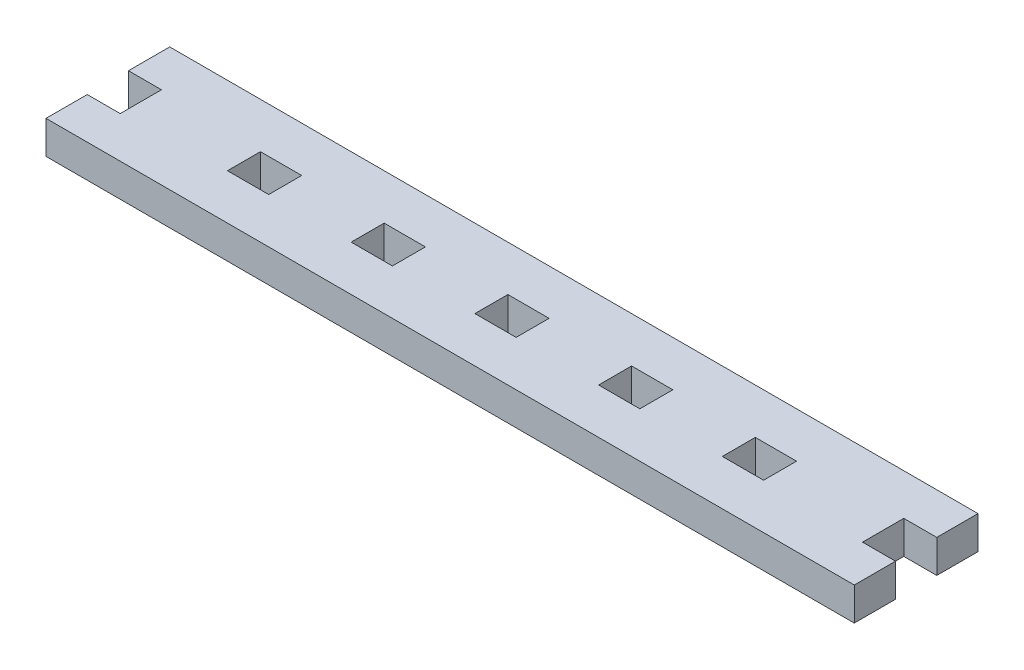
ISO-10303-21;
HEADER;
FILE_DESCRIPTION(('STEP AP214'),'2;1');
FILE_NAME('part.step','',(''),(''),'','','');
FILE_SCHEMA(('AUTOMOTIVE_DESIGN { 1 0 10303 214 1 1 1 1 }'));
ENDSEC;
DATA;
#1=APPLICATION_CONTEXT('core data for automotive mechanical design processes');
#2=APPLICATION_PROTOCOL_DEFINITION('international standard','automotive_design',2000,#1);
#3=PRODUCT_CONTEXT('',#1,'mechanical');
#4=PRODUCT('Part','Part','',(#3));
#5=PRODUCT_RELATED_PRODUCT_CATEGORY('part','',(#4));
#6=PRODUCT_DEFINITION_FORMATION('','',#4);
#7=PRODUCT_DEFINITION_CONTEXT('part definition',#1,'design');
#8=PRODUCT_DEFINITION('design','',#6,#7);
#9=PRODUCT_DEFINITION_SHAPE('','',#8);
#10=(LENGTH_UNIT() NAMED_UNIT(*) SI_UNIT(.MILLI.,.METRE.));
#11=(NAMED_UNIT(*) PLANE_ANGLE_UNIT() SI_UNIT($,.RADIAN.));
#12=(NAMED_UNIT(*) SI_UNIT($,.STERADIAN.) SOLID_ANGLE_UNIT());
#13=UNCERTAINTY_MEASURE_WITH_UNIT(LENGTH_MEASURE(1.E-05),#10,'distance_accuracy_value','');
#14=(GEOMETRIC_REPRESENTATION_CONTEXT(3) GLOBAL_UNCERTAINTY_ASSIGNED_CONTEXT((#13)) GLOBAL_UNIT_ASSIGNED_CONTEXT((#10,
#11,#12)) REPRESENTATION_CONTEXT('',''));
#15=CARTESIAN_POINT('',(0.,0.,0.));
#16=DIRECTION('',(0.,0.,1.));
#17=DIRECTION('',(1.,0.,0.));
#18=AXIS2_PLACEMENT_3D('',#15,#16,#17);
#19=CARTESIAN_POINT('',(97.155,0.,-6.985));
#20=DIRECTION('',(0.,0.,1.));
#21=DIRECTION('',(1.,0.,0.));
#22=AXIS2_PLACEMENT_3D('',#19,#20,#21);
#23=PLANE('',#22);
#24=DIRECTION('',(1.,0.,0.));
#25=VECTOR('',#24,1.);
#26=CARTESIAN_POINT('',(97.155,5.08,-6.985));
#27=LINE('',#26,#25);
#28=CARTESIAN_POINT('',(97.155,5.08,-6.985));
#29=VERTEX_POINT('',#28);
#30=CARTESIAN_POINT('',(103.505,5.08,-6.985));
#31=VERTEX_POINT('',#30);
#32=EDGE_CURVE('E474',#29,#31,#27,.T.);
#33=ORIENTED_EDGE('',*,*,#32,.T.);
#34=DIRECTION('',(0.,1.,0.));
#35=VECTOR('',#34,1.);
#36=CARTESIAN_POINT('',(103.505,0.,-6.985));
#37=LINE('',#36,#35);
#38=CARTESIAN_POINT('',(103.505,0.,-6.985));
#39=VERTEX_POINT('',#38);
#40=EDGE_CURVE('E11',#39,#31,#37,.T.);
#41=ORIENTED_EDGE('',*,*,#40,.F.);
#42=DIRECTION('',(1.,0.,0.));
#43=VECTOR('',#42,1.);
#44=CARTESIAN_POINT('',(97.155,0.,-6.985));
#45=LINE('',#44,#43);
#46=CARTESIAN_POINT('',(97.155,0.,-6.985));
#47=VERTEX_POINT('',#46);
#48=EDGE_CURVE('E478',#47,#39,#45,.T.);
#49=ORIENTED_EDGE('',*,*,#48,.F.);
#50=DIRECTION('',(0.,1.,0.));
#51=VECTOR('',#50,1.);
#52=CARTESIAN_POINT('',(97.155,0.,-6.985));
#53=LINE('',#52,#51);
#54=EDGE_CURVE('E483',#47,#29,#53,.T.);
#55=ORIENTED_EDGE('',*,*,#54,.T.);
#56=EDGE_LOOP('',(#33,#41,#49,#55));
#57=FACE_BOUND('',#56,.T.);
#58=ADVANCED_FACE('F33',(#57),#23,.F.);
#59=CARTESIAN_POINT('',(103.505,0.,-12.065));
#60=DIRECTION('',(1.,0.,0.));
#61=DIRECTION('',(0.,0.,-1.));
#62=AXIS2_PLACEMENT_3D('',#59,#60,#61);
#63=PLANE('',#62);
#64=DIRECTION('',(0.,0.,-1.));
#65=VECTOR('',#64,1.);
#66=CARTESIAN_POINT('',(103.505,5.08,-12.065));
#67=LINE('',#66,#65);
#68=CARTESIAN_POINT('',(103.505,5.08,-12.065));
#69=VERTEX_POINT('',#68);
#70=EDGE_CURVE('E471',#31,#69,#67,.T.);
#71=ORIENTED_EDGE('',*,*,#70,.T.);
#72=DIRECTION('',(0.,1.,0.));
#73=VECTOR('',#72,1.);
#74=CARTESIAN_POINT('',(103.505,0.,-12.065));
#75=LINE('',#74,#73);
#76=CARTESIAN_POINT('',(103.505,0.,-12.065));
#77=VERTEX_POINT('',#76);
#78=EDGE_CURVE('E40',#77,#69,#75,.T.);
#79=ORIENTED_EDGE('',*,*,#78,.F.);
#80=DIRECTION('',(0.,0.,-1.));
#81=VECTOR('',#80,1.);
#82=CARTESIAN_POINT('',(103.505,0.,-12.065));
#83=LINE('',#82,#81);
#84=EDGE_CURVE('E54',#39,#77,#83,.T.);
#85=ORIENTED_EDGE('',*,*,#84,.F.);
#86=ORIENTED_EDGE('',*,*,#40,.T.);
#87=EDGE_LOOP('',(#71,#79,#85,#86));
#88=FACE_BOUND('',#87,.T.);
#89=ADVANCED_FACE('F493',(#88),#63,.F.);
#90=CARTESIAN_POINT('',(97.155,0.,-12.065));
#91=DIRECTION('',(0.,0.,-1.));
#92=DIRECTION('',(-1.,0.,0.));
#93=AXIS2_PLACEMENT_3D('',#90,#91,#92);
#94=PLANE('',#93);
#95=DIRECTION('',(-1.,0.,0.));
#96=VECTOR('',#95,1.);
#97=CARTESIAN_POINT('',(97.155,5.08,-12.065));
#98=LINE('',#97,#96);
#99=CARTESIAN_POINT('',(97.155,5.08,-12.065));
#100=VERTEX_POINT('',#99);
#101=EDGE_CURVE('E468',#69,#100,#98,.T.);
#102=ORIENTED_EDGE('',*,*,#101,.T.);
#103=DIRECTION('',(0.,1.,0.));
#104=VECTOR('',#103,1.);
#105=CARTESIAN_POINT('',(97.155,0.,-12.065));
#106=LINE('',#105,#104);
#107=CARTESIAN_POINT('',(97.155,0.,-12.065));
#108=VERTEX_POINT('',#107);
#109=EDGE_CURVE('E486',#108,#100,#106,.T.);
#110=ORIENTED_EDGE('',*,*,#109,.F.);
#111=DIRECTION('',(-1.,0.,0.));
#112=VECTOR('',#111,1.);
#113=CARTESIAN_POINT('',(97.155,0.,-12.065));
#114=LINE('',#113,#112);
#115=EDGE_CURVE('E481',#77,#108,#114,.T.);
#116=ORIENTED_EDGE('',*,*,#115,.F.);
#117=ORIENTED_EDGE('',*,*,#78,.T.);
#118=EDGE_LOOP('',(#102,#110,#116,#117));
#119=FACE_BOUND('',#118,.T.);
#120=ADVANCED_FACE('F490',(#119),#94,.F.);
#121=CARTESIAN_POINT('',(97.155,0.,-12.065));
#122=DIRECTION('',(-1.,0.,0.));
#123=DIRECTION('',(0.,0.,1.));
#124=AXIS2_PLACEMENT_3D('',#121,#122,#123);
#125=PLANE('',#124);
#126=DIRECTION('',(0.,0.,1.));
#127=VECTOR('',#126,1.);
#128=CARTESIAN_POINT('',(97.155,5.08,-12.065));
#129=LINE('',#128,#127);
#130=EDGE_CURVE('E466',#100,#29,#129,.T.);
#131=ORIENTED_EDGE('',*,*,#130,.T.);
#132=ORIENTED_EDGE('',*,*,#54,.F.);
#133=DIRECTION('',(0.,0.,1.));
#134=VECTOR('',#133,1.);
#135=CARTESIAN_POINT('',(97.155,0.,-12.065));
#136=LINE('',#135,#134);
#137=EDGE_CURVE('E47',#108,#47,#136,.T.);
#138=ORIENTED_EDGE('',*,*,#137,.F.);
#139=ORIENTED_EDGE('',*,*,#109,.T.);
#140=EDGE_LOOP('',(#131,#132,#138,#139));
#141=FACE_BOUND('',#140,.T.);
#142=ADVANCED_FACE('F499',(#141),#125,.F.);
#143=CARTESIAN_POINT('',(78.105,0.,-6.985));
#144=DIRECTION('',(0.,0.,1.));
#145=DIRECTION('',(1.,0.,0.));
#146=AXIS2_PLACEMENT_3D('',#143,#144,#145);
#147=PLANE('',#146);
#148=DIRECTION('',(1.,0.,0.));
#149=VECTOR('',#148,1.);
#150=CARTESIAN_POINT('',(78.105,5.08,-6.985));
#151=LINE('',#150,#149);
#152=CARTESIAN_POINT('',(78.105,5.08,-6.985));
#153=VERTEX_POINT('',#152);
#154=CARTESIAN_POINT('',(84.455,5.08,-6.985));
#155=VERTEX_POINT('',#154);
#156=EDGE_CURVE('E442',#153,#155,#151,.T.);
#157=ORIENTED_EDGE('',*,*,#156,.T.);
#158=DIRECTION('',(0.,1.,0.));
#159=VECTOR('',#158,1.);
#160=CARTESIAN_POINT('',(84.455,0.,-6.985));
#161=LINE('',#160,#159);
#162=CARTESIAN_POINT('',(84.455,0.,-6.985));
#163=VERTEX_POINT('',#162);
#164=EDGE_CURVE('E463',#163,#155,#161,.T.);
#165=ORIENTED_EDGE('',*,*,#164,.F.);
#166=DIRECTION('',(1.,0.,0.));
#167=VECTOR('',#166,1.);
#168=CARTESIAN_POINT('',(78.105,0.,-6.985));
#169=LINE('',#168,#167);
#170=CARTESIAN_POINT('',(78.105,0.,-6.985));
#171=VERTEX_POINT('',#170);
#172=EDGE_CURVE('E447',#171,#163,#169,.T.);
#173=ORIENTED_EDGE('',*,*,#172,.F.);
#174=DIRECTION('',(0.,1.,0.));
#175=VECTOR('',#174,1.);
#176=CARTESIAN_POINT('',(78.105,0.,-6.985));
#177=LINE('',#176,#175);
#178=EDGE_CURVE('E454',#171,#153,#177,.T.);
#179=ORIENTED_EDGE('',*,*,#178,.T.);
#180=EDGE_LOOP('',(#157,#165,#173,#179));
#181=FACE_BOUND('',#180,.T.);
#182=ADVANCED_FACE('F501',(#181),#147,.F.);
#183=CARTESIAN_POINT('',(84.455,0.,-12.065));
#184=DIRECTION('',(1.,0.,0.));
#185=DIRECTION('',(0.,0.,-1.));
#186=AXIS2_PLACEMENT_3D('',#183,#184,#185);
#187=PLANE('',#186);
#188=DIRECTION('',(0.,0.,-1.));
#189=VECTOR('',#188,1.);
#190=CARTESIAN_POINT('',(84.455,5.08,-12.065));
#191=LINE('',#190,#189);
#192=CARTESIAN_POINT('',(84.455,5.08,-12.065));
#193=VERTEX_POINT('',#192);
#194=EDGE_CURVE('E439',#155,#193,#191,.T.);
#195=ORIENTED_EDGE('',*,*,#194,.T.);
#196=DIRECTION('',(0.,1.,0.));
#197=VECTOR('',#196,1.);
#198=CARTESIAN_POINT('',(84.455,0.,-12.065));
#199=LINE('',#198,#197);
#200=CARTESIAN_POINT('',(84.455,0.,-12.065));
#201=VERTEX_POINT('',#200);
#202=EDGE_CURVE('E460',#201,#193,#199,.T.);
#203=ORIENTED_EDGE('',*,*,#202,.F.);
#204=DIRECTION('',(0.,0.,-1.));
#205=VECTOR('',#204,1.);
#206=CARTESIAN_POINT('',(84.455,0.,-12.065));
#207=LINE('',#206,#205);
#208=EDGE_CURVE('E449',#163,#201,#207,.T.);
#209=ORIENTED_EDGE('',*,*,#208,.F.);
#210=ORIENTED_EDGE('',*,*,#164,.T.);
#211=EDGE_LOOP('',(#195,#203,#209,#210));
#212=FACE_BOUND('',#211,.T.);
#213=ADVANCED_FACE('F507',(#212),#187,.F.);
#214=CARTESIAN_POINT('',(78.105,0.,-12.065));
#215=DIRECTION('',(0.,0.,-1.));
#216=DIRECTION('',(-1.,0.,0.));
#217=AXIS2_PLACEMENT_3D('',#214,#215,#216);
#218=PLANE('',#217);
#219=DIRECTION('',(-1.,0.,0.));
#220=VECTOR('',#219,1.);
#221=CARTESIAN_POINT('',(78.105,5.08,-12.065));
#222=LINE('',#221,#220);
#223=CARTESIAN_POINT('',(78.105,5.08,-12.065));
#224=VERTEX_POINT('',#223);
#225=EDGE_CURVE('E436',#193,#224,#222,.T.);
#226=ORIENTED_EDGE('',*,*,#225,.T.);
#227=DIRECTION('',(0.,1.,0.));
#228=VECTOR('',#227,1.);
#229=CARTESIAN_POINT('',(78.105,0.,-12.065));
#230=LINE('',#229,#228);
#231=CARTESIAN_POINT('',(78.105,0.,-12.065));
#232=VERTEX_POINT('',#231);
#233=EDGE_CURVE('E457',#232,#224,#230,.T.);
#234=ORIENTED_EDGE('',*,*,#233,.F.);
#235=DIRECTION('',(-1.,0.,0.));
#236=VECTOR('',#235,1.);
#237=CARTESIAN_POINT('',(78.105,0.,-12.065));
#238=LINE('',#237,#236);
#239=EDGE_CURVE('E451',#201,#232,#238,.T.);
#240=ORIENTED_EDGE('',*,*,#239,.F.);
#241=ORIENTED_EDGE('',*,*,#202,.T.);
#242=EDGE_LOOP('',(#226,#234,#240,#241));
#243=FACE_BOUND('',#242,.T.);
#244=ADVANCED_FACE('F540',(#243),#218,.F.);
#245=CARTESIAN_POINT('',(78.105,0.,-12.065));
#246=DIRECTION('',(-1.,0.,0.));
#247=DIRECTION('',(0.,0.,1.));
#248=AXIS2_PLACEMENT_3D('',#245,#246,#247);
#249=PLANE('',#248);
#250=DIRECTION('',(0.,0.,1.));
#251=VECTOR('',#250,1.);
#252=CARTESIAN_POINT('',(78.105,5.08,-12.065));
#253=LINE('',#252,#251);
#254=EDGE_CURVE('E434',#224,#153,#253,.T.);
#255=ORIENTED_EDGE('',*,*,#254,.T.);
#256=ORIENTED_EDGE('',*,*,#178,.F.);
#257=DIRECTION('',(0.,0.,1.));
#258=VECTOR('',#257,1.);
#259=CARTESIAN_POINT('',(78.105,0.,-12.065));
#260=LINE('',#259,#258);
#261=EDGE_CURVE('E445',#232,#171,#260,.T.);
#262=ORIENTED_EDGE('',*,*,#261,.F.);
#263=ORIENTED_EDGE('',*,*,#233,.T.);
#264=EDGE_LOOP('',(#255,#256,#262,#263));
#265=FACE_BOUND('',#264,.T.);
#266=ADVANCED_FACE('F550',(#265),#249,.F.);
#267=CARTESIAN_POINT('',(59.055,0.,-6.985));
#268=DIRECTION('',(0.,0.,1.));
#269=DIRECTION('',(1.,0.,0.));
#270=AXIS2_PLACEMENT_3D('',#267,#268,#269);
#271=PLANE('',#270);
#272=DIRECTION('',(1.,0.,0.));
#273=VECTOR('',#272,1.);
#274=CARTESIAN_POINT('',(59.055,5.08,-6.985));
#275=LINE('',#274,#273);
#276=CARTESIAN_POINT('',(59.055,5.08,-6.985));
#277=VERTEX_POINT('',#276);
#278=CARTESIAN_POINT('',(65.405,5.08,-6.985));
#279=VERTEX_POINT('',#278);
#280=EDGE_CURVE('E410',#277,#279,#275,.T.);
#281=ORIENTED_EDGE('',*,*,#280,.T.);
#282=DIRECTION('',(0.,1.,0.));
#283=VECTOR('',#282,1.);
#284=CARTESIAN_POINT('',(65.405,0.,-6.985));
#285=LINE('',#284,#283);
#286=CARTESIAN_POINT('',(65.405,0.,-6.985));
#287=VERTEX_POINT('',#286);
#288=EDGE_CURVE('E431',#287,#279,#285,.T.);
#289=ORIENTED_EDGE('',*,*,#288,.F.);
#290=DIRECTION('',(1.,0.,0.));
#291=VECTOR('',#290,1.);
#292=CARTESIAN_POINT('',(59.055,0.,-6.985));
#293=LINE('',#292,#291);
#294=CARTESIAN_POINT('',(59.055,0.,-6.985));
#295=VERTEX_POINT('',#294);
#296=EDGE_CURVE('E415',#295,#287,#293,.T.);
#297=ORIENTED_EDGE('',*,*,#296,.F.);
#298=DIRECTION('',(0.,1.,0.));
#299=VECTOR('',#298,1.);
#300=CARTESIAN_POINT('',(59.055,0.,-6.985));
#301=LINE('',#300,#299);
#302=EDGE_CURVE('E422',#295,#277,#301,.T.);
#303=ORIENTED_EDGE('',*,*,#302,.T.);
#304=EDGE_LOOP('',(#281,#289,#297,#303));
#305=FACE_BOUND('',#304,.T.);
#306=ADVANCED_FACE('F560',(#305),#271,.F.);
#307=CARTESIAN_POINT('',(65.405,0.,-12.065));
#308=DIRECTION('',(1.,0.,0.));
#309=DIRECTION('',(0.,0.,-1.));
#310=AXIS2_PLACEMENT_3D('',#307,#308,#309);
#311=PLANE('',#310);
#312=DIRECTION('',(0.,0.,-1.));
#313=VECTOR('',#312,1.);
#314=CARTESIAN_POINT('',(65.405,5.08,-12.065));
#315=LINE('',#314,#313);
#316=CARTESIAN_POINT('',(65.405,5.08,-12.065));
#317=VERTEX_POINT('',#316);
#318=EDGE_CURVE('E407',#279,#317,#315,.T.);
#319=ORIENTED_EDGE('',*,*,#318,.T.);
#320=DIRECTION('',(0.,1.,0.));
#321=VECTOR('',#320,1.);
#322=CARTESIAN_POINT('',(65.405,0.,-12.065));
#323=LINE('',#322,#321);
#324=CARTESIAN_POINT('',(65.405,0.,-12.065));
#325=VERTEX_POINT('',#324);
#326=EDGE_CURVE('E428',#325,#317,#323,.T.);
#327=ORIENTED_EDGE('',*,*,#326,.F.);
#328=DIRECTION('',(0.,0.,-1.));
#329=VECTOR('',#328,1.);
#330=CARTESIAN_POINT('',(65.405,0.,-12.065));
#331=LINE('',#330,#329);
#332=EDGE_CURVE('E417',#287,#325,#331,.T.);
#333=ORIENTED_EDGE('',*,*,#332,.F.);
#334=ORIENTED_EDGE('',*,*,#288,.T.);
#335=EDGE_LOOP('',(#319,#327,#333,#334));
#336=FACE_BOUND('',#335,.T.);
#337=ADVANCED_FACE('F570',(#336),#311,.F.);
#338=CARTESIAN_POINT('',(59.055,0.,-12.065));
#339=DIRECTION('',(0.,0.,-1.));
#340=DIRECTION('',(-1.,0.,0.));
#341=AXIS2_PLACEMENT_3D('',#338,#339,#340);
#342=PLANE('',#341);
#343=DIRECTION('',(-1.,0.,0.));
#344=VECTOR('',#343,1.);
#345=CARTESIAN_POINT('',(59.055,5.08,-12.065));
#346=LINE('',#345,#344);
#347=CARTESIAN_POINT('',(59.055,5.08,-12.065));
#348=VERTEX_POINT('',#347);
#349=EDGE_CURVE('E404',#317,#348,#346,.T.);
#350=ORIENTED_EDGE('',*,*,#349,.T.);
#351=DIRECTION('',(0.,1.,0.));
#352=VECTOR('',#351,1.);
#353=CARTESIAN_POINT('',(59.055,0.,-12.065));
#354=LINE('',#353,#352);
#355=CARTESIAN_POINT('',(59.055,0.,-12.065));
#356=VERTEX_POINT('',#355);
#357=EDGE_CURVE('E425',#356,#348,#354,.T.);
#358=ORIENTED_EDGE('',*,*,#357,.F.);
#359=DIRECTION('',(-1.,0.,0.));
#360=VECTOR('',#359,1.);
#361=CARTESIAN_POINT('',(59.055,0.,-12.065));
#362=LINE('',#361,#360);
#363=EDGE_CURVE('E419',#325,#356,#362,.T.);
#364=ORIENTED_EDGE('',*,*,#363,.F.);
#365=ORIENTED_EDGE('',*,*,#326,.T.);
#366=EDGE_LOOP('',(#350,#358,#364,#365));
#367=FACE_BOUND('',#366,.T.);
#368=ADVANCED_FACE('F580',(#367),#342,.F.);
#369=CARTESIAN_POINT('',(59.055,0.,-12.065));
#370=DIRECTION('',(-1.,0.,0.));
#371=DIRECTION('',(0.,0.,1.));
#372=AXIS2_PLACEMENT_3D('',#369,#370,#371);
#373=PLANE('',#372);
#374=DIRECTION('',(0.,0.,1.));
#375=VECTOR('',#374,1.);
#376=CARTESIAN_POINT('',(59.055,5.08,-12.065));
#377=LINE('',#376,#375);
#378=EDGE_CURVE('E402',#348,#277,#377,.T.);
#379=ORIENTED_EDGE('',*,*,#378,.T.);
#380=ORIENTED_EDGE('',*,*,#302,.F.);
#381=DIRECTION('',(0.,0.,1.));
#382=VECTOR('',#381,1.);
#383=CARTESIAN_POINT('',(59.055,0.,-12.065));
#384=LINE('',#383,#382);
#385=EDGE_CURVE('E413',#356,#295,#384,.T.);
#386=ORIENTED_EDGE('',*,*,#385,.F.);
#387=ORIENTED_EDGE('',*,*,#357,.T.);
#388=EDGE_LOOP('',(#379,#380,#386,#387));
#389=FACE_BOUND('',#388,.T.);
#390=ADVANCED_FACE('F590',(#389),#373,.F.);
#391=CARTESIAN_POINT('',(0.,5.08,0.));
#392=DIRECTION('',(1.,0.,0.));
#393=DIRECTION('',(0.,0.,-1.));
#394=AXIS2_PLACEMENT_3D('',#391,#392,#393);
#395=PLANE('',#394);
#396=DIRECTION('',(0.,0.,1.));
#397=VECTOR('',#396,1.);
#398=CARTESIAN_POINT('',(0.,0.,0.));
#399=LINE('',#398,#397);
#400=CARTESIAN_POINT('',(0.,0.,-6.35));
#401=VERTEX_POINT('',#400);
#402=CARTESIAN_POINT('',(0.,0.,0.));
#403=VERTEX_POINT('',#402);
#404=EDGE_CURVE('E310',#401,#403,#399,.T.);
#405=ORIENTED_EDGE('',*,*,#404,.T.);
#406=DIRECTION('',(0.,-1.,0.));
#407=VECTOR('',#406,1.);
#408=CARTESIAN_POINT('',(0.,5.08,0.));
#409=LINE('',#408,#407);
#410=CARTESIAN_POINT('',(0.,5.08,0.));
#411=VERTEX_POINT('',#410);
#412=EDGE_CURVE('E399',#411,#403,#409,.T.);
#413=ORIENTED_EDGE('',*,*,#412,.F.);
#414=DIRECTION('',(0.,0.,1.));
#415=VECTOR('',#414,1.);
#416=CARTESIAN_POINT('',(0.,5.08,0.));
#417=LINE('',#416,#415);
#418=CARTESIAN_POINT('',(0.,5.08,-6.35));
#419=VERTEX_POINT('',#418);
#420=EDGE_CURVE('E317',#419,#411,#417,.T.);
#421=ORIENTED_EDGE('',*,*,#420,.F.);
#422=DIRECTION('',(0.,-1.,0.));
#423=VECTOR('',#422,1.);
#424=CARTESIAN_POINT('',(0.,5.08,-6.35));
#425=LINE('',#424,#423);
#426=EDGE_CURVE('E343',#419,#401,#425,.T.);
#427=ORIENTED_EDGE('',*,*,#426,.T.);
#428=EDGE_LOOP('',(#405,#413,#421,#427));
#429=FACE_BOUND('',#428,.T.);
#430=ADVANCED_FACE('F600',(#429),#395,.F.);
#431=CARTESIAN_POINT('',(0.,5.08,0.));
#432=DIRECTION('',(0.,0.,-1.));
#433=DIRECTION('',(-1.,0.,0.));
#434=AXIS2_PLACEMENT_3D('',#431,#432,#433);
#435=PLANE('',#434);
#436=DIRECTION('',(1.,0.,0.));
#437=VECTOR('',#436,1.);
#438=CARTESIAN_POINT('',(0.,0.,0.));
#439=LINE('',#438,#437);
#440=CARTESIAN_POINT('',(124.46,0.,0.));
#441=VERTEX_POINT('',#440);
#442=EDGE_CURVE('E346',#403,#441,#439,.T.);
#443=ORIENTED_EDGE('',*,*,#442,.T.);
#444=DIRECTION('',(0.,-1.,0.));
#445=VECTOR('',#444,1.);
#446=CARTESIAN_POINT('',(124.46,5.08,0.));
#447=LINE('',#446,#445);
#448=CARTESIAN_POINT('',(124.46,5.08,0.));
#449=VERTEX_POINT('',#448);
#450=EDGE_CURVE('E396',#449,#441,#447,.T.);
#451=ORIENTED_EDGE('',*,*,#450,.F.);
#452=DIRECTION('',(1.,0.,0.));
#453=VECTOR('',#452,1.);
#454=CARTESIAN_POINT('',(0.,5.08,0.));
#455=LINE('',#454,#453);
#456=EDGE_CURVE('E320',#411,#449,#455,.T.);
#457=ORIENTED_EDGE('',*,*,#456,.F.);
#458=ORIENTED_EDGE('',*,*,#412,.T.);
#459=EDGE_LOOP('',(#443,#451,#457,#458));
#460=FACE_BOUND('',#459,.T.);
#461=ADVANCED_FACE('F718',(#460),#435,.F.);
#462=CARTESIAN_POINT('',(124.46,5.08,0.));
#463=DIRECTION('',(-1.,0.,0.));
#464=DIRECTION('',(0.,0.,1.));
#465=AXIS2_PLACEMENT_3D('',#462,#463,#464);
#466=PLANE('',#465);
#467=DIRECTION('',(0.,0.,-1.));
#468=VECTOR('',#467,1.);
#469=CARTESIAN_POINT('',(124.46,0.,0.));
#470=LINE('',#469,#468);
#471=CARTESIAN_POINT('',(124.46,0.,-6.35));
#472=VERTEX_POINT('',#471);
#473=EDGE_CURVE('E348',#441,#472,#470,.T.);
#474=ORIENTED_EDGE('',*,*,#473,.T.);
#475=DIRECTION('',(0.,-1.,0.));
#476=VECTOR('',#475,1.);
#477=CARTESIAN_POINT('',(124.46,5.08,-6.35));
#478=LINE('',#477,#476);
#479=CARTESIAN_POINT('',(124.46,5.08,-6.35));
#480=VERTEX_POINT('',#479);
#481=EDGE_CURVE('E393',#480,#472,#478,.T.);
#482=ORIENTED_EDGE('',*,*,#481,.F.);
#483=DIRECTION('',(0.,0.,-1.));
#484=VECTOR('',#483,1.);
#485=CARTESIAN_POINT('',(124.46,5.08,0.));
#486=LINE('',#485,#484);
#487=EDGE_CURVE('E323',#449,#480,#486,.T.);
#488=ORIENTED_EDGE('',*,*,#487,.F.);
#489=ORIENTED_EDGE('',*,*,#450,.T.);
#490=EDGE_LOOP('',(#474,#482,#488,#489));
#491=FACE_BOUND('',#490,.T.);
#492=ADVANCED_FACE('F714',(#491),#466,.F.);
#493=CARTESIAN_POINT('',(124.46,5.08,-6.35));
#494=DIRECTION('',(0.,0.,1.));
#495=DIRECTION('',(1.,0.,0.));
#496=AXIS2_PLACEMENT_3D('',#493,#494,#495);
#497=PLANE('',#496);
#498=DIRECTION('',(-1.,0.,0.));
#499=VECTOR('',#498,1.);
#500=CARTESIAN_POINT('',(124.46,0.,-6.35));
#501=LINE('',#500,#499);
#502=CARTESIAN_POINT('',(119.38,0.,-6.35));
#503=VERTEX_POINT('',#502);
#504=EDGE_CURVE('E350',#472,#503,#501,.T.);
#505=ORIENTED_EDGE('',*,*,#504,.T.);
#506=DIRECTION('',(0.,-1.,0.));
#507=VECTOR('',#506,1.);
#508=CARTESIAN_POINT('',(119.38,5.08,-6.35));
#509=LINE('',#508,#507);
#510=CARTESIAN_POINT('',(119.38,5.08,-6.35));
#511=VERTEX_POINT('',#510);
#512=EDGE_CURVE('E390',#511,#503,#509,.T.);
#513=ORIENTED_EDGE('',*,*,#512,.F.);
#514=DIRECTION('',(-1.,0.,0.));
#515=VECTOR('',#514,1.);
#516=CARTESIAN_POINT('',(124.46,5.08,-6.35));
#517=LINE('',#516,#515);
#518=EDGE_CURVE('E325',#480,#511,#517,.T.);
#519=ORIENTED_EDGE('',*,*,#518,.F.);
#520=ORIENTED_EDGE('',*,*,#481,.T.);
#521=EDGE_LOOP('',(#505,#513,#519,#520));
#522=FACE_BOUND('',#521,.T.);
#523=ADVANCED_FACE('F710',(#522),#497,.F.);
#524=CARTESIAN_POINT('',(119.38,5.08,-12.7));
#525=DIRECTION('',(-1.,0.,0.));
#526=DIRECTION('',(0.,0.,1.));
#527=AXIS2_PLACEMENT_3D('',#524,#525,#526);
#528=PLANE('',#527);
#529=DIRECTION('',(0.,0.,-1.));
#530=VECTOR('',#529,1.);
#531=CARTESIAN_POINT('',(119.38,0.,-12.7));
#532=LINE('',#531,#530);
#533=CARTESIAN_POINT('',(119.38,0.,-12.7));
#534=VERTEX_POINT('',#533);
#535=EDGE_CURVE('E352',#503,#534,#532,.T.);
#536=ORIENTED_EDGE('',*,*,#535,.T.);
#537=DIRECTION('',(0.,-1.,0.));
#538=VECTOR('',#537,1.);
#539=CARTESIAN_POINT('',(119.38,5.08,-12.7));
#540=LINE('',#539,#538);
#541=CARTESIAN_POINT('',(119.38,5.08,-12.7));
#542=VERTEX_POINT('',#541);
#543=EDGE_CURVE('E387',#542,#534,#540,.T.);
#544=ORIENTED_EDGE('',*,*,#543,.F.);
#545=DIRECTION('',(0.,0.,-1.));
#546=VECTOR('',#545,1.);
#547=CARTESIAN_POINT('',(119.38,5.08,-12.7));
#548=LINE('',#547,#546);
#549=EDGE_CURVE('E327',#511,#542,#548,.T.);
#550=ORIENTED_EDGE('',*,*,#549,.F.);
#551=ORIENTED_EDGE('',*,*,#512,.T.);
#552=EDGE_LOOP('',(#536,#544,#550,#551));
#553=FACE_BOUND('',#552,.T.);
#554=ADVANCED_FACE('F706',(#553),#528,.F.);
#555=CARTESIAN_POINT('',(124.46,5.08,-12.7));
#556=DIRECTION('',(0.,0.,-1.));
#557=DIRECTION('',(-1.,0.,0.));
#558=AXIS2_PLACEMENT_3D('',#555,#556,#557);
#559=PLANE('',#558);
#560=DIRECTION('',(1.,0.,0.));
#561=VECTOR('',#560,1.);
#562=CARTESIAN_POINT('',(124.46,0.,-12.7));
#563=LINE('',#562,#561);
#564=CARTESIAN_POINT('',(124.46,0.,-12.7));
#565=VERTEX_POINT('',#564);
#566=EDGE_CURVE('E354',#534,#565,#563,.T.);
#567=ORIENTED_EDGE('',*,*,#566,.T.);
#568=DIRECTION('',(0.,-1.,0.));
#569=VECTOR('',#568,1.);
#570=CARTESIAN_POINT('',(124.46,5.08,-12.7));
#571=LINE('',#570,#569);
#572=CARTESIAN_POINT('',(124.46,5.08,-12.7));
#573=VERTEX_POINT('',#572);
#574=EDGE_CURVE('E384',#573,#565,#571,.T.);
#575=ORIENTED_EDGE('',*,*,#574,.F.);
#576=DIRECTION('',(1.,0.,0.));
#577=VECTOR('',#576,1.);
#578=CARTESIAN_POINT('',(124.46,5.08,-12.7));
#579=LINE('',#578,#577);
#580=EDGE_CURVE('E329',#542,#573,#579,.T.);
#581=ORIENTED_EDGE('',*,*,#580,.F.);
#582=ORIENTED_EDGE('',*,*,#543,.T.);
#583=EDGE_LOOP('',(#567,#575,#581,#582));
#584=FACE_BOUND('',#583,.T.);
#585=ADVANCED_FACE('F702',(#584),#559,.F.);
#586=CARTESIAN_POINT('',(124.46,5.08,-12.7));
#587=DIRECTION('',(-1.,0.,0.));
#588=DIRECTION('',(0.,0.,1.));
#589=AXIS2_PLACEMENT_3D('',#586,#587,#588);
#590=PLANE('',#589);
#591=DIRECTION('',(0.,0.,-1.));
#592=VECTOR('',#591,1.);
#593=CARTESIAN_POINT('',(124.46,0.,-12.7));
#594=LINE('',#593,#592);
#595=CARTESIAN_POINT('',(124.46,0.,-19.05));
#596=VERTEX_POINT('',#595);
#597=EDGE_CURVE('E356',#565,#596,#594,.T.);
#598=ORIENTED_EDGE('',*,*,#597,.T.);
#599=DIRECTION('',(0.,-1.,0.));
#600=VECTOR('',#599,1.);
#601=CARTESIAN_POINT('',(124.46,5.08,-19.05));
#602=LINE('',#601,#600);
#603=CARTESIAN_POINT('',(124.46,5.08,-19.05));
#604=VERTEX_POINT('',#603);
#605=EDGE_CURVE('E381',#604,#596,#602,.T.);
#606=ORIENTED_EDGE('',*,*,#605,.F.);
#607=DIRECTION('',(0.,0.,-1.));
#608=VECTOR('',#607,1.);
#609=CARTESIAN_POINT('',(124.46,5.08,-12.7));
#610=LINE('',#609,#608);
#611=EDGE_CURVE('E331',#573,#604,#610,.T.);
#612=ORIENTED_EDGE('',*,*,#611,.F.);
#613=ORIENTED_EDGE('',*,*,#574,.T.);
#614=EDGE_LOOP('',(#598,#606,#612,#613));
#615=FACE_BOUND('',#614,.T.);
#616=ADVANCED_FACE('F698',(#615),#590,.F.);
#617=CARTESIAN_POINT('',(0.,5.08,-19.05));
#618=DIRECTION('',(0.,0.,1.));
#619=DIRECTION('',(1.,0.,0.));
#620=AXIS2_PLACEMENT_3D('',#617,#618,#619);
#621=PLANE('',#620);
#622=DIRECTION('',(-1.,0.,0.));
#623=VECTOR('',#622,1.);
#624=CARTESIAN_POINT('',(0.,0.,-19.05));
#625=LINE('',#624,#623);
#626=CARTESIAN_POINT('',(0.,0.,-19.05));
#627=VERTEX_POINT('',#626);
#628=EDGE_CURVE('E358',#596,#627,#625,.T.);
#629=ORIENTED_EDGE('',*,*,#628,.T.);
#630=DIRECTION('',(0.,-1.,0.));
#631=VECTOR('',#630,1.);
#632=CARTESIAN_POINT('',(0.,5.08,-19.05));
#633=LINE('',#632,#631);
#634=CARTESIAN_POINT('',(0.,5.08,-19.05));
#635=VERTEX_POINT('',#634);
#636=EDGE_CURVE('E378',#635,#627,#633,.T.);
#637=ORIENTED_EDGE('',*,*,#636,.F.);
#638=DIRECTION('',(-1.,0.,0.));
#639=VECTOR('',#638,1.);
#640=CARTESIAN_POINT('',(0.,5.08,-19.05));
#641=LINE('',#640,#639);
#642=EDGE_CURVE('E333',#604,#635,#641,.T.);
#643=ORIENTED_EDGE('',*,*,#642,.F.);
#644=ORIENTED_EDGE('',*,*,#605,.T.);
#645=EDGE_LOOP('',(#629,#637,#643,#644));
#646=FACE_BOUND('',#645,.T.);
#647=ADVANCED_FACE('F694',(#646),#621,.F.);
#648=CARTESIAN_POINT('',(0.,5.08,-12.7));
#649=DIRECTION('',(1.,0.,0.));
#650=DIRECTION('',(0.,0.,-1.));
#651=AXIS2_PLACEMENT_3D('',#648,#649,#650);
#652=PLANE('',#651);
#653=DIRECTION('',(0.,0.,1.));
#654=VECTOR('',#653,1.);
#655=CARTESIAN_POINT('',(0.,0.,-12.7));
#656=LINE('',#655,#654);
#657=CARTESIAN_POINT('',(0.,0.,-12.7));
#658=VERTEX_POINT('',#657);
#659=EDGE_CURVE('E360',#627,#658,#656,.T.);
#660=ORIENTED_EDGE('',*,*,#659,.T.);
#661=DIRECTION('',(0.,-1.,0.));
#662=VECTOR('',#661,1.);
#663=CARTESIAN_POINT('',(0.,5.08,-12.7));
#664=LINE('',#663,#662);
#665=CARTESIAN_POINT('',(0.,5.08,-12.7));
#666=VERTEX_POINT('',#665);
#667=EDGE_CURVE('E375',#666,#658,#664,.T.);
#668=ORIENTED_EDGE('',*,*,#667,.F.);
#669=DIRECTION('',(0.,0.,1.));
#670=VECTOR('',#669,1.);
#671=CARTESIAN_POINT('',(0.,5.08,-12.7));
#672=LINE('',#671,#670);
#673=EDGE_CURVE('E335',#635,#666,#672,.T.);
#674=ORIENTED_EDGE('',*,*,#673,.F.);
#675=ORIENTED_EDGE('',*,*,#636,.T.);
#676=EDGE_LOOP('',(#660,#668,#674,#675));
#677=FACE_BOUND('',#676,.T.);
#678=ADVANCED_FACE('F690',(#677),#652,.F.);
#679=CARTESIAN_POINT('',(0.,5.08,-12.7));
#680=DIRECTION('',(0.,0.,-1.));
#681=DIRECTION('',(-1.,0.,0.));
#682=AXIS2_PLACEMENT_3D('',#679,#680,#681);
#683=PLANE('',#682);
#684=DIRECTION('',(1.,0.,0.));
#685=VECTOR('',#684,1.);
#686=CARTESIAN_POINT('',(0.,0.,-12.7));
#687=LINE('',#686,#685);
#688=CARTESIAN_POINT('',(5.08,0.,-12.7));
#689=VERTEX_POINT('',#688);
#690=EDGE_CURVE('E362',#658,#689,#687,.T.);
#691=ORIENTED_EDGE('',*,*,#690,.T.);
#692=DIRECTION('',(0.,-1.,0.));
#693=VECTOR('',#692,1.);
#694=CARTESIAN_POINT('',(5.08,5.08,-12.7));
#695=LINE('',#694,#693);
#696=CARTESIAN_POINT('',(5.08,5.08,-12.7));
#697=VERTEX_POINT('',#696);
#698=EDGE_CURVE('E372',#697,#689,#695,.T.);
#699=ORIENTED_EDGE('',*,*,#698,.F.);
#700=DIRECTION('',(1.,0.,0.));
#701=VECTOR('',#700,1.);
#702=CARTESIAN_POINT('',(0.,5.08,-12.7));
#703=LINE('',#702,#701);
#704=EDGE_CURVE('E337',#666,#697,#703,.T.);
#705=ORIENTED_EDGE('',*,*,#704,.F.);
#706=ORIENTED_EDGE('',*,*,#667,.T.);
#707=EDGE_LOOP('',(#691,#699,#705,#706));
#708=FACE_BOUND('',#707,.T.);
#709=ADVANCED_FACE('F686',(#708),#683,.F.);
#710=CARTESIAN_POINT('',(5.08,5.08,-12.7));
#711=DIRECTION('',(1.,0.,0.));
#712=DIRECTION('',(0.,0.,-1.));
#713=AXIS2_PLACEMENT_3D('',#710,#711,#712);
#714=PLANE('',#713);
#715=DIRECTION('',(0.,0.,1.));
#716=VECTOR('',#715,1.);
#717=CARTESIAN_POINT('',(5.08,0.,-12.7));
#718=LINE('',#717,#716);
#719=CARTESIAN_POINT('',(5.08,0.,-6.35));
#720=VERTEX_POINT('',#719);
#721=EDGE_CURVE('E364',#689,#720,#718,.T.);
#722=ORIENTED_EDGE('',*,*,#721,.T.);
#723=DIRECTION('',(0.,-1.,0.));
#724=VECTOR('',#723,1.);
#725=CARTESIAN_POINT('',(5.08,5.08,-6.35));
#726=LINE('',#725,#724);
#727=CARTESIAN_POINT('',(5.08,5.08,-6.35));
#728=VERTEX_POINT('',#727);
#729=EDGE_CURVE('E369',#728,#720,#726,.T.);
#730=ORIENTED_EDGE('',*,*,#729,.F.);
#731=DIRECTION('',(0.,0.,1.));
#732=VECTOR('',#731,1.);
#733=CARTESIAN_POINT('',(5.08,5.08,-12.7));
#734=LINE('',#733,#732);
#735=EDGE_CURVE('E339',#697,#728,#734,.T.);
#736=ORIENTED_EDGE('',*,*,#735,.F.);
#737=ORIENTED_EDGE('',*,*,#698,.T.);
#738=EDGE_LOOP('',(#722,#730,#736,#737));
#739=FACE_BOUND('',#738,.T.);
#740=ADVANCED_FACE('F682',(#739),#714,.F.);
#741=CARTESIAN_POINT('',(0.,5.08,-6.35));
#742=DIRECTION('',(0.,0.,1.));
#743=DIRECTION('',(1.,0.,0.));
#744=AXIS2_PLACEMENT_3D('',#741,#742,#743);
#745=PLANE('',#744);
#746=DIRECTION('',(-1.,0.,0.));
#747=VECTOR('',#746,1.);
#748=CARTESIAN_POINT('',(0.,0.,-6.35));
#749=LINE('',#748,#747);
#750=EDGE_CURVE('E321',#720,#401,#749,.T.);
#751=ORIENTED_EDGE('',*,*,#750,.T.);
#752=ORIENTED_EDGE('',*,*,#426,.F.);
#753=DIRECTION('',(-1.,0.,0.));
#754=VECTOR('',#753,1.);
#755=CARTESIAN_POINT('',(0.,5.08,-6.35));
#756=LINE('',#755,#754);
#757=EDGE_CURVE('E341',#728,#419,#756,.T.);
#758=ORIENTED_EDGE('',*,*,#757,.F.);
#759=ORIENTED_EDGE('',*,*,#729,.T.);
#760=EDGE_LOOP('',(#751,#752,#758,#759));
#761=FACE_BOUND('',#760,.T.);
#762=ADVANCED_FACE('F613',(#761),#745,.F.);
#763=CARTESIAN_POINT('',(0.,5.08,0.));
#764=DIRECTION('',(0.,-1.,0.));
#765=DIRECTION('',(0.,0.,-1.));
#766=AXIS2_PLACEMENT_3D('',#763,#764,#765);
#767=PLANE('',#766);
#768=DIRECTION('',(1.,0.,0.));
#769=VECTOR('',#768,1.);
#770=CARTESIAN_POINT('',(40.005,5.08,-6.985));
#771=LINE('',#770,#769);
#772=CARTESIAN_POINT('',(40.005,5.08,-6.985));
#773=VERTEX_POINT('',#772);
#774=CARTESIAN_POINT('',(46.355,5.08,-6.985));
#775=VERTEX_POINT('',#774);
#776=EDGE_CURVE('E243',#773,#775,#771,.T.);
#777=ORIENTED_EDGE('',*,*,#776,.F.);
#778=DIRECTION('',(0.,0.,1.));
#779=VECTOR('',#778,1.);
#780=CARTESIAN_POINT('',(40.005,5.08,-12.065));
#781=LINE('',#780,#779);
#782=CARTESIAN_POINT('',(40.005,5.08,-12.065));
#783=VERTEX_POINT('',#782);
#784=EDGE_CURVE('E279',#783,#773,#781,.T.);
#785=ORIENTED_EDGE('',*,*,#784,.F.);
#786=DIRECTION('',(-1.,0.,0.));
#787=VECTOR('',#786,1.);
#788=CARTESIAN_POINT('',(40.005,5.08,-12.065));
#789=LINE('',#788,#787);
#790=CARTESIAN_POINT('',(46.355,5.08,-12.065));
#791=VERTEX_POINT('',#790);
#792=EDGE_CURVE('E265',#791,#783,#789,.T.);
#793=ORIENTED_EDGE('',*,*,#792,.F.);
#794=DIRECTION('',(0.,0.,-1.));
#795=VECTOR('',#794,1.);
#796=CARTESIAN_POINT('',(46.355,5.08,-12.065));
#797=LINE('',#796,#795);
#798=EDGE_CURVE('E257',#775,#791,#797,.T.);
#799=ORIENTED_EDGE('',*,*,#798,.F.);
#800=EDGE_LOOP('',(#777,#785,#793,#799));
#801=FACE_BOUND('',#800,.T.);
#802=DIRECTION('',(1.,0.,0.));
#803=VECTOR('',#802,1.);
#804=CARTESIAN_POINT('',(20.955,5.08,-6.985));
#805=LINE('',#804,#803);
#806=CARTESIAN_POINT('',(20.955,5.08,-6.985));
#807=VERTEX_POINT('',#806);
#808=CARTESIAN_POINT('',(27.305,5.08,-6.985));
#809=VERTEX_POINT('',#808);
#810=EDGE_CURVE('E300',#807,#809,#805,.T.);
#811=ORIENTED_EDGE('',*,*,#810,.F.);
#812=DIRECTION('',(0.,0.,1.));
#813=VECTOR('',#812,1.);
#814=CARTESIAN_POINT('',(20.955,5.08,-12.065));
#815=LINE('',#814,#813);
#816=CARTESIAN_POINT('',(20.955,5.08,-12.065));
#817=VERTEX_POINT('',#816);
#818=EDGE_CURVE('E284',#817,#807,#815,.T.);
#819=ORIENTED_EDGE('',*,*,#818,.F.);
#820=DIRECTION('',(-1.,0.,0.));
#821=VECTOR('',#820,1.);
#822=CARTESIAN_POINT('',(20.955,5.08,-12.065));
#823=LINE('',#822,#821);
#824=CARTESIAN_POINT('',(27.305,5.08,-12.065));
#825=VERTEX_POINT('',#824);
#826=EDGE_CURVE('E289',#825,#817,#823,.T.);
#827=ORIENTED_EDGE('',*,*,#826,.F.);
#828=DIRECTION('',(0.,0.,-1.));
#829=VECTOR('',#828,1.);
#830=CARTESIAN_POINT('',(27.305,5.08,-12.065));
#831=LINE('',#830,#829);
#832=EDGE_CURVE('E303',#809,#825,#831,.T.);
#833=ORIENTED_EDGE('',*,*,#832,.F.);
#834=EDGE_LOOP('',(#811,#819,#827,#833));
#835=FACE_BOUND('',#834,.T.);
#836=ORIENTED_EDGE('',*,*,#420,.T.);
#837=ORIENTED_EDGE('',*,*,#456,.T.);
#838=ORIENTED_EDGE('',*,*,#487,.T.);
#839=ORIENTED_EDGE('',*,*,#518,.T.);
#840=ORIENTED_EDGE('',*,*,#549,.T.);
#841=ORIENTED_EDGE('',*,*,#580,.T.);
#842=ORIENTED_EDGE('',*,*,#611,.T.);
#843=ORIENTED_EDGE('',*,*,#642,.T.);
#844=ORIENTED_EDGE('',*,*,#673,.T.);
#845=ORIENTED_EDGE('',*,*,#704,.T.);
#846=ORIENTED_EDGE('',*,*,#735,.T.);
#847=ORIENTED_EDGE('',*,*,#757,.T.);
#848=EDGE_LOOP('',(#836,#837,#838,#839,#840,#841,#842,#843,#844,#845,#846,#847));
#849=FACE_BOUND('',#848,.T.);
#850=ORIENTED_EDGE('',*,*,#378,.F.);
#851=ORIENTED_EDGE('',*,*,#349,.F.);
#852=ORIENTED_EDGE('',*,*,#318,.F.);
#853=ORIENTED_EDGE('',*,*,#280,.F.);
#854=EDGE_LOOP('',(#850,#851,#852,#853));
#855=FACE_BOUND('',#854,.T.);
#856=ORIENTED_EDGE('',*,*,#254,.F.);
#857=ORIENTED_EDGE('',*,*,#225,.F.);
#858=ORIENTED_EDGE('',*,*,#194,.F.);
#859=ORIENTED_EDGE('',*,*,#156,.F.);
#860=EDGE_LOOP('',(#856,#857,#858,#859));
#861=FACE_BOUND('',#860,.T.);
#862=ORIENTED_EDGE('',*,*,#130,.F.);
#863=ORIENTED_EDGE('',*,*,#101,.F.);
#864=ORIENTED_EDGE('',*,*,#70,.F.);
#865=ORIENTED_EDGE('',*,*,#32,.F.);
#866=EDGE_LOOP('',(#862,#863,#864,#865));
#867=FACE_BOUND('',#866,.T.);
#868=ADVANCED_FACE('F263',(#801,#835,#849,#855,#861,#867),#767,.F.);
#869=CARTESIAN_POINT('',(0.,0.,0.));
#870=DIRECTION('',(0.,-1.,0.));
#871=DIRECTION('',(0.,0.,-1.));
#872=AXIS2_PLACEMENT_3D('',#869,#870,#871);
#873=PLANE('',#872);
#874=DIRECTION('',(0.,0.,1.));
#875=VECTOR('',#874,1.);
#876=CARTESIAN_POINT('',(40.005,0.,-12.065));
#877=LINE('',#876,#875);
#878=CARTESIAN_POINT('',(40.005,0.,-12.065));
#879=VERTEX_POINT('',#878);
#880=CARTESIAN_POINT('',(40.005,0.,-6.985));
#881=VERTEX_POINT('',#880);
#882=EDGE_CURVE('E281',#879,#881,#877,.T.);
#883=ORIENTED_EDGE('',*,*,#882,.T.);
#884=DIRECTION('',(1.,0.,0.));
#885=VECTOR('',#884,1.);
#886=CARTESIAN_POINT('',(40.005,0.,-6.985));
#887=LINE('',#886,#885);
#888=CARTESIAN_POINT('',(46.355,0.,-6.985));
#889=VERTEX_POINT('',#888);
#890=EDGE_CURVE('E253',#881,#889,#887,.T.);
#891=ORIENTED_EDGE('',*,*,#890,.T.);
#892=DIRECTION('',(0.,0.,-1.));
#893=VECTOR('',#892,1.);
#894=CARTESIAN_POINT('',(46.355,0.,-12.065));
#895=LINE('',#894,#893);
#896=CARTESIAN_POINT('',(46.355,0.,-12.065));
#897=VERTEX_POINT('',#896);
#898=EDGE_CURVE('E260',#889,#897,#895,.T.);
#899=ORIENTED_EDGE('',*,*,#898,.T.);
#900=DIRECTION('',(-1.,0.,0.));
#901=VECTOR('',#900,1.);
#902=CARTESIAN_POINT('',(40.005,0.,-12.065));
#903=LINE('',#902,#901);
#904=EDGE_CURVE('E276',#897,#879,#903,.T.);
#905=ORIENTED_EDGE('',*,*,#904,.T.);
#906=EDGE_LOOP('',(#883,#891,#899,#905));
#907=FACE_BOUND('',#906,.T.);
#908=DIRECTION('',(0.,0.,1.));
#909=VECTOR('',#908,1.);
#910=CARTESIAN_POINT('',(20.955,0.,-12.065));
#911=LINE('',#910,#909);
#912=CARTESIAN_POINT('',(20.955,0.,-12.065));
#913=VERTEX_POINT('',#912);
#914=CARTESIAN_POINT('',(20.955,0.,-6.985));
#915=VERTEX_POINT('',#914);
#916=EDGE_CURVE('E285',#913,#915,#911,.T.);
#917=ORIENTED_EDGE('',*,*,#916,.T.);
#918=DIRECTION('',(1.,0.,0.));
#919=VECTOR('',#918,1.);
#920=CARTESIAN_POINT('',(20.955,0.,-6.985));
#921=LINE('',#920,#919);
#922=CARTESIAN_POINT('',(27.305,0.,-6.985));
#923=VERTEX_POINT('',#922);
#924=EDGE_CURVE('E288',#915,#923,#921,.T.);
#925=ORIENTED_EDGE('',*,*,#924,.T.);
#926=DIRECTION('',(0.,0.,-1.));
#927=VECTOR('',#926,1.);
#928=CARTESIAN_POINT('',(27.305,0.,-12.065));
#929=LINE('',#928,#927);
#930=CARTESIAN_POINT('',(27.305,0.,-12.065));
#931=VERTEX_POINT('',#930);
#932=EDGE_CURVE('E292',#923,#931,#929,.T.);
#933=ORIENTED_EDGE('',*,*,#932,.T.);
#934=DIRECTION('',(-1.,0.,0.));
#935=VECTOR('',#934,1.);
#936=CARTESIAN_POINT('',(20.955,0.,-12.065));
#937=LINE('',#936,#935);
#938=EDGE_CURVE('E295',#931,#913,#937,.T.);
#939=ORIENTED_EDGE('',*,*,#938,.T.);
#940=EDGE_LOOP('',(#917,#925,#933,#939));
#941=FACE_BOUND('',#940,.T.);
#942=ORIENTED_EDGE('',*,*,#404,.F.);
#943=ORIENTED_EDGE('',*,*,#750,.F.);
#944=ORIENTED_EDGE('',*,*,#721,.F.);
#945=ORIENTED_EDGE('',*,*,#690,.F.);
#946=ORIENTED_EDGE('',*,*,#659,.F.);
#947=ORIENTED_EDGE('',*,*,#628,.F.);
#948=ORIENTED_EDGE('',*,*,#597,.F.);
#949=ORIENTED_EDGE('',*,*,#566,.F.);
#950=ORIENTED_EDGE('',*,*,#535,.F.);
#951=ORIENTED_EDGE('',*,*,#504,.F.);
#952=ORIENTED_EDGE('',*,*,#473,.F.);
#953=ORIENTED_EDGE('',*,*,#442,.F.);
#954=EDGE_LOOP('',(#942,#943,#944,#945,#946,#947,#948,#949,#950,#951,#952,#953));
#955=FACE_BOUND('',#954,.T.);
#956=ORIENTED_EDGE('',*,*,#385,.T.);
#957=ORIENTED_EDGE('',*,*,#296,.T.);
#958=ORIENTED_EDGE('',*,*,#332,.T.);
#959=ORIENTED_EDGE('',*,*,#363,.T.);
#960=EDGE_LOOP('',(#956,#957,#958,#959));
#961=FACE_BOUND('',#960,.T.);
#962=ORIENTED_EDGE('',*,*,#261,.T.);
#963=ORIENTED_EDGE('',*,*,#172,.T.);
#964=ORIENTED_EDGE('',*,*,#208,.T.);
#965=ORIENTED_EDGE('',*,*,#239,.T.);
#966=EDGE_LOOP('',(#962,#963,#964,#965));
#967=FACE_BOUND('',#966,.T.);
#968=ORIENTED_EDGE('',*,*,#137,.T.);
#969=ORIENTED_EDGE('',*,*,#48,.T.);
#970=ORIENTED_EDGE('',*,*,#84,.T.);
#971=ORIENTED_EDGE('',*,*,#115,.T.);
#972=EDGE_LOOP('',(#968,#969,#970,#971));
#973=FACE_BOUND('',#972,.T.);
#974=ADVANCED_FACE('F612',(#907,#941,#955,#961,#967,#973),#873,.T.);
#975=CARTESIAN_POINT('',(20.955,0.,-12.065));
#976=DIRECTION('',(-1.,0.,0.));
#977=DIRECTION('',(0.,0.,1.));
#978=AXIS2_PLACEMENT_3D('',#975,#976,#977);
#979=PLANE('',#978);
#980=ORIENTED_EDGE('',*,*,#818,.T.);
#981=DIRECTION('',(0.,1.,0.));
#982=VECTOR('',#981,1.);
#983=CARTESIAN_POINT('',(20.955,0.,-6.985));
#984=LINE('',#983,#982);
#985=EDGE_CURVE('E298',#915,#807,#984,.T.);
#986=ORIENTED_EDGE('',*,*,#985,.F.);
#987=ORIENTED_EDGE('',*,*,#916,.F.);
#988=DIRECTION('',(0.,1.,0.));
#989=VECTOR('',#988,1.);
#990=CARTESIAN_POINT('',(20.955,0.,-12.065));
#991=LINE('',#990,#989);
#992=EDGE_CURVE('E308',#913,#817,#991,.T.);
#993=ORIENTED_EDGE('',*,*,#992,.T.);
#994=EDGE_LOOP('',(#980,#986,#987,#993));
#995=FACE_BOUND('',#994,.T.);
#996=ADVANCED_FACE('F624',(#995),#979,.F.);
#997=CARTESIAN_POINT('',(20.955,0.,-12.065));
#998=DIRECTION('',(0.,0.,-1.));
#999=DIRECTION('',(-1.,0.,0.));
#1000=AXIS2_PLACEMENT_3D('',#997,#998,#999);
#1001=PLANE('',#1000);
#1002=ORIENTED_EDGE('',*,*,#826,.T.);
#1003=ORIENTED_EDGE('',*,*,#992,.F.);
#1004=ORIENTED_EDGE('',*,*,#938,.F.);
#1005=DIRECTION('',(0.,1.,0.));
#1006=VECTOR('',#1005,1.);
#1007=CARTESIAN_POINT('',(27.305,0.,-12.065));
#1008=LINE('',#1007,#1006);
#1009=EDGE_CURVE('E311',#931,#825,#1008,.T.);
#1010=ORIENTED_EDGE('',*,*,#1009,.T.);
#1011=EDGE_LOOP('',(#1002,#1003,#1004,#1010));
#1012=FACE_BOUND('',#1011,.T.);
#1013=ADVANCED_FACE('F669',(#1012),#1001,.F.);
#1014=CARTESIAN_POINT('',(27.305,0.,-12.065));
#1015=DIRECTION('',(1.,0.,0.));
#1016=DIRECTION('',(0.,0.,-1.));
#1017=AXIS2_PLACEMENT_3D('',#1014,#1015,#1016);
#1018=PLANE('',#1017);
#1019=ORIENTED_EDGE('',*,*,#832,.T.);
#1020=ORIENTED_EDGE('',*,*,#1009,.F.);
#1021=ORIENTED_EDGE('',*,*,#932,.F.);
#1022=DIRECTION('',(0.,1.,0.));
#1023=VECTOR('',#1022,1.);
#1024=CARTESIAN_POINT('',(27.305,0.,-6.985));
#1025=LINE('',#1024,#1023);
#1026=EDGE_CURVE('E313',#923,#809,#1025,.T.);
#1027=ORIENTED_EDGE('',*,*,#1026,.T.);
#1028=EDGE_LOOP('',(#1019,#1020,#1021,#1027));
#1029=FACE_BOUND('',#1028,.T.);
#1030=ADVANCED_FACE('F672',(#1029),#1018,.F.);
#1031=CARTESIAN_POINT('',(20.955,0.,-6.985));
#1032=DIRECTION('',(0.,0.,1.));
#1033=DIRECTION('',(1.,0.,0.));
#1034=AXIS2_PLACEMENT_3D('',#1031,#1032,#1033);
#1035=PLANE('',#1034);
#1036=ORIENTED_EDGE('',*,*,#810,.T.);
#1037=ORIENTED_EDGE('',*,*,#1026,.F.);
#1038=ORIENTED_EDGE('',*,*,#924,.F.);
#1039=ORIENTED_EDGE('',*,*,#985,.T.);
#1040=EDGE_LOOP('',(#1036,#1037,#1038,#1039));
#1041=FACE_BOUND('',#1040,.T.);
#1042=ADVANCED_FACE('F637',(#1041),#1035,.F.);
#1043=CARTESIAN_POINT('',(40.005,0.,-12.065));
#1044=DIRECTION('',(-1.,0.,0.));
#1045=DIRECTION('',(0.,0.,1.));
#1046=AXIS2_PLACEMENT_3D('',#1043,#1044,#1045);
#1047=PLANE('',#1046);
#1048=ORIENTED_EDGE('',*,*,#784,.T.);
#1049=DIRECTION('',(0.,1.,0.));
#1050=VECTOR('',#1049,1.);
#1051=CARTESIAN_POINT('',(40.005,0.,-6.985));
#1052=LINE('',#1051,#1050);
#1053=EDGE_CURVE('E249',#881,#773,#1052,.T.);
#1054=ORIENTED_EDGE('',*,*,#1053,.F.);
#1055=ORIENTED_EDGE('',*,*,#882,.F.);
#1056=DIRECTION('',(0.,1.,0.));
#1057=VECTOR('',#1056,1.);
#1058=CARTESIAN_POINT('',(40.005,0.,-12.065));
#1059=LINE('',#1058,#1057);
#1060=EDGE_CURVE('E273',#879,#783,#1059,.T.);
#1061=ORIENTED_EDGE('',*,*,#1060,.T.);
#1062=EDGE_LOOP('',(#1048,#1054,#1055,#1061));
#1063=FACE_BOUND('',#1062,.T.);
#1064=ADVANCED_FACE('F632',(#1063),#1047,.F.);
#1065=CARTESIAN_POINT('',(40.005,0.,-12.065));
#1066=DIRECTION('',(0.,0.,-1.));
#1067=DIRECTION('',(-1.,0.,0.));
#1068=AXIS2_PLACEMENT_3D('',#1065,#1066,#1067);
#1069=PLANE('',#1068);
#1070=ORIENTED_EDGE('',*,*,#792,.T.);
#1071=ORIENTED_EDGE('',*,*,#1060,.F.);
#1072=ORIENTED_EDGE('',*,*,#904,.F.);
#1073=DIRECTION('',(0.,1.,0.));
#1074=VECTOR('',#1073,1.);
#1075=CARTESIAN_POINT('',(46.355,0.,-12.065));
#1076=LINE('',#1075,#1074);
#1077=EDGE_CURVE('E266',#897,#791,#1076,.T.);
#1078=ORIENTED_EDGE('',*,*,#1077,.T.);
#1079=EDGE_LOOP('',(#1070,#1071,#1072,#1078));
#1080=FACE_BOUND('',#1079,.T.);
#1081=ADVANCED_FACE('F636',(#1080),#1069,.F.);
#1082=CARTESIAN_POINT('',(46.355,0.,-12.065));
#1083=DIRECTION('',(1.,0.,0.));
#1084=DIRECTION('',(0.,0.,-1.));
#1085=AXIS2_PLACEMENT_3D('',#1082,#1083,#1084);
#1086=PLANE('',#1085);
#1087=ORIENTED_EDGE('',*,*,#798,.T.);
#1088=ORIENTED_EDGE('',*,*,#1077,.F.);
#1089=ORIENTED_EDGE('',*,*,#898,.F.);
#1090=DIRECTION('',(0.,1.,0.));
#1091=VECTOR('',#1090,1.);
#1092=CARTESIAN_POINT('',(46.355,0.,-6.985));
#1093=LINE('',#1092,#1091);
#1094=EDGE_CURVE('E246',#889,#775,#1093,.T.);
#1095=ORIENTED_EDGE('',*,*,#1094,.T.);
#1096=EDGE_LOOP('',(#1087,#1088,#1089,#1095));
#1097=FACE_BOUND('',#1096,.T.);
#1098=ADVANCED_FACE('F256',(#1097),#1086,.F.);
#1099=CARTESIAN_POINT('',(40.005,0.,-6.985));
#1100=DIRECTION('',(0.,0.,1.));
#1101=DIRECTION('',(1.,0.,0.));
#1102=AXIS2_PLACEMENT_3D('',#1099,#1100,#1101);
#1103=PLANE('',#1102);
#1104=ORIENTED_EDGE('',*,*,#776,.T.);
#1105=ORIENTED_EDGE('',*,*,#1094,.F.);
#1106=ORIENTED_EDGE('',*,*,#890,.F.);
#1107=ORIENTED_EDGE('',*,*,#1053,.T.);
#1108=EDGE_LOOP('',(#1104,#1105,#1106,#1107));
#1109=FACE_BOUND('',#1108,.T.);
#1110=ADVANCED_FACE('F245',(#1109),#1103,.F.);
#1111=CLOSED_SHELL('',(#58,#89,#120,#142,#182,#213,#244,#266,#306,#337,#368,#390,#430,#461,#492,
#523,#554,#585,#616,#647,#678,#709,#740,#762,#868,#974,#996,#1013,#1030,#1042,#1064,#1081,#1098,#1110));
#1112=MANIFOLD_SOLID_BREP('B2',#1111);
#1113=ADVANCED_BREP_SHAPE_REPRESENTATION('',(#18,#1112),#14);
#1114=SHAPE_DEFINITION_REPRESENTATION(#9,#1113);
ENDSEC;
END-ISO-10303-21;
